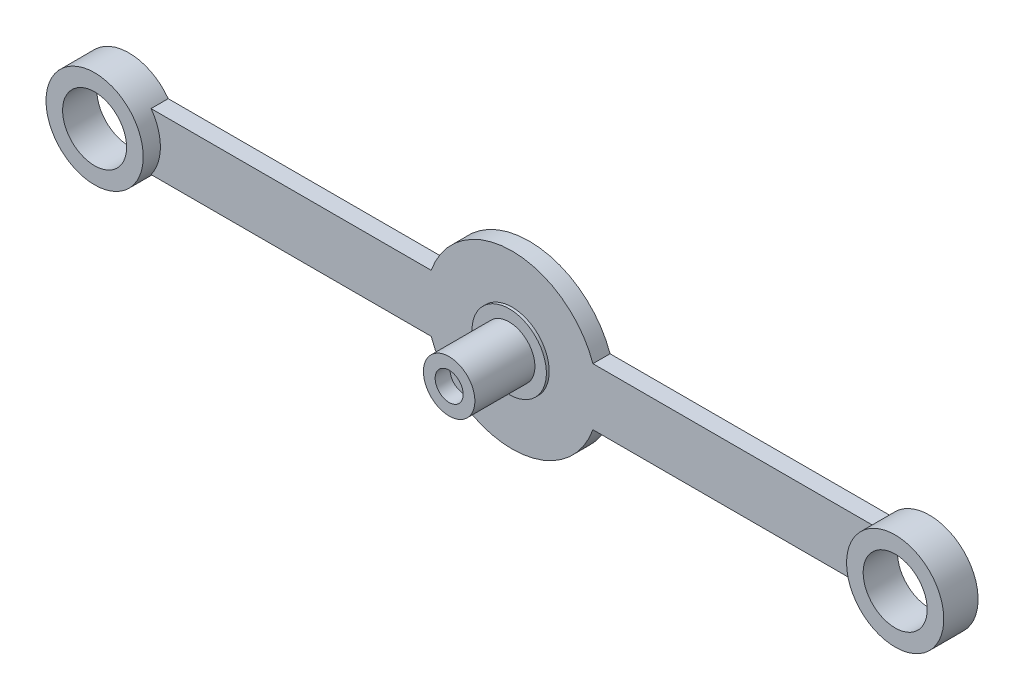
ISO-10303-21;
HEADER;
FILE_DESCRIPTION(('STEP AP214'),'2;1');
FILE_NAME('part.step','',(''),(''),'','','');
FILE_SCHEMA(('AUTOMOTIVE_DESIGN { 1 0 10303 214 1 1 1 1 }'));
ENDSEC;
DATA;
#1=APPLICATION_CONTEXT('core data for automotive mechanical design processes');
#2=APPLICATION_PROTOCOL_DEFINITION('international standard','automotive_design',2000,#1);
#3=PRODUCT_CONTEXT('',#1,'mechanical');
#4=PRODUCT('Part','Part','',(#3));
#5=PRODUCT_RELATED_PRODUCT_CATEGORY('part','',(#4));
#6=PRODUCT_DEFINITION_FORMATION('','',#4);
#7=PRODUCT_DEFINITION_CONTEXT('part definition',#1,'design');
#8=PRODUCT_DEFINITION('design','',#6,#7);
#9=PRODUCT_DEFINITION_SHAPE('','',#8);
#10=(LENGTH_UNIT() NAMED_UNIT(*) SI_UNIT(.MILLI.,.METRE.));
#11=(NAMED_UNIT(*) PLANE_ANGLE_UNIT() SI_UNIT($,.RADIAN.));
#12=(NAMED_UNIT(*) SI_UNIT($,.STERADIAN.) SOLID_ANGLE_UNIT());
#13=UNCERTAINTY_MEASURE_WITH_UNIT(LENGTH_MEASURE(1.E-05),#10,'distance_accuracy_value','');
#14=(GEOMETRIC_REPRESENTATION_CONTEXT(3) GLOBAL_UNCERTAINTY_ASSIGNED_CONTEXT((#13)) GLOBAL_UNIT_ASSIGNED_CONTEXT((#10,
#11,#12)) REPRESENTATION_CONTEXT('',''));
#15=CARTESIAN_POINT('',(0.,0.,0.));
#16=DIRECTION('',(0.,0.,1.));
#17=DIRECTION('',(1.,0.,0.));
#18=AXIS2_PLACEMENT_3D('',#15,#16,#17);
#19=CARTESIAN_POINT('',(0.,0.,-3.));
#20=DIRECTION('',(0.,0.,1.));
#21=DIRECTION('',(1.,0.,0.));
#22=AXIS2_PLACEMENT_3D('',#19,#20,#21);
#23=CYLINDRICAL_SURFACE('',#22,1.2);
#24=CARTESIAN_POINT('',(0.,0.,8.4));
#25=DIRECTION('',(0.,0.,-1.));
#26=DIRECTION('',(-1.,0.,0.));
#27=AXIS2_PLACEMENT_3D('',#24,#25,#26);
#28=CIRCLE('',#27,1.2);
#29=CARTESIAN_POINT('',(-1.2,0.,8.4));
#30=VERTEX_POINT('',#29);
#31=EDGE_CURVE('E200',#30,#30,#28,.T.);
#32=ORIENTED_EDGE('',*,*,#31,.F.);
#33=EDGE_LOOP('',(#32));
#34=FACE_BOUND('',#33,.T.);
#35=CARTESIAN_POINT('',(0.,0.,5.9));
#36=DIRECTION('',(0.,0.,-1.));
#37=DIRECTION('',(-1.,0.,0.));
#38=AXIS2_PLACEMENT_3D('',#35,#36,#37);
#39=CIRCLE('',#38,1.2);
#40=CARTESIAN_POINT('',(-1.2,0.,5.9));
#41=VERTEX_POINT('',#40);
#42=EDGE_CURVE('E50',#41,#41,#39,.F.);
#43=ORIENTED_EDGE('',*,*,#42,.F.);
#44=EDGE_LOOP('',(#43));
#45=FACE_BOUND('',#44,.T.);
#46=ADVANCED_FACE('F46',(#34,#45),#23,.F.);
#47=CARTESIAN_POINT('',(0.,0.,-3.));
#48=DIRECTION('',(0.,0.,1.));
#49=DIRECTION('',(1.,0.,0.));
#50=AXIS2_PLACEMENT_3D('',#47,#48,#49);
#51=CYLINDRICAL_SURFACE('',#50,15.);
#52=CARTESIAN_POINT('',(0.,0.,0.));
#53=DIRECTION('',(0.,0.,1.));
#54=DIRECTION('',(-1.,0.,0.));
#55=AXIS2_PLACEMENT_3D('',#52,#53,#54);
#56=CIRCLE('',#55,15.);
#57=CARTESIAN_POINT('',(14.142135623731,5.,0.));
#58=VERTEX_POINT('',#57);
#59=CARTESIAN_POINT('',(-14.142135623731,5.00000000000001,0.));
#60=VERTEX_POINT('',#59);
#61=EDGE_CURVE('E156',#58,#60,#56,.T.);
#62=ORIENTED_EDGE('',*,*,#61,.F.);
#63=DIRECTION('',(0.,0.,1.));
#64=VECTOR('',#63,1.);
#65=CARTESIAN_POINT('',(14.142135623731,5.,-3.));
#66=LINE('',#65,#64);
#67=CARTESIAN_POINT('',(14.142135623731,5.,-3.));
#68=VERTEX_POINT('',#67);
#69=EDGE_CURVE('E66',#68,#58,#66,.T.);
#70=ORIENTED_EDGE('',*,*,#69,.F.);
#71=CARTESIAN_POINT('',(0.,0.,-3.));
#72=DIRECTION('',(0.,0.,1.));
#73=DIRECTION('',(-1.,0.,0.));
#74=AXIS2_PLACEMENT_3D('',#71,#72,#73);
#75=CIRCLE('',#74,15.);
#76=CARTESIAN_POINT('',(-14.142135623731,5.00000000000001,-3.));
#77=VERTEX_POINT('',#76);
#78=EDGE_CURVE('E179',#68,#77,#75,.T.);
#79=ORIENTED_EDGE('',*,*,#78,.T.);
#80=DIRECTION('',(0.,0.,1.));
#81=VECTOR('',#80,1.);
#82=CARTESIAN_POINT('',(-14.142135623731,5.00000000000001,-3.));
#83=LINE('',#82,#81);
#84=EDGE_CURVE('E103',#77,#60,#83,.T.);
#85=ORIENTED_EDGE('',*,*,#84,.T.);
#86=EDGE_LOOP('',(#62,#70,#79,#85));
#87=FACE_BOUND('',#86,.T.);
#88=ADVANCED_FACE('F287',(#87),#51,.T.);
#89=CARTESIAN_POINT('',(14.142135623731,5.,-3.));
#90=DIRECTION('',(0.,1.,0.));
#91=DIRECTION('',(0.,0.,1.));
#92=AXIS2_PLACEMENT_3D('',#89,#90,#91);
#93=PLANE('',#92);
#94=DIRECTION('',(-1.,0.,0.));
#95=VECTOR('',#94,1.);
#96=CARTESIAN_POINT('',(14.142135623731,5.,0.));
#97=LINE('',#96,#95);
#98=CARTESIAN_POINT('',(63.1261364575662,5.,0.));
#99=VERTEX_POINT('',#98);
#100=EDGE_CURVE('E176',#99,#58,#97,.T.);
#101=ORIENTED_EDGE('',*,*,#100,.F.);
#102=DIRECTION('',(0.,0.,1.));
#103=VECTOR('',#102,1.);
#104=CARTESIAN_POINT('',(63.1261364575662,5.,-3.));
#105=LINE('',#104,#103);
#106=CARTESIAN_POINT('',(63.1261364575662,5.,-3.));
#107=VERTEX_POINT('',#106);
#108=EDGE_CURVE('E133',#107,#99,#105,.T.);
#109=ORIENTED_EDGE('',*,*,#108,.F.);
#110=DIRECTION('',(-1.,0.,0.));
#111=VECTOR('',#110,1.);
#112=CARTESIAN_POINT('',(14.142135623731,5.,-3.));
#113=LINE('',#112,#111);
#114=EDGE_CURVE('E142',#107,#68,#113,.T.);
#115=ORIENTED_EDGE('',*,*,#114,.T.);
#116=ORIENTED_EDGE('',*,*,#69,.T.);
#117=EDGE_LOOP('',(#101,#109,#115,#116));
#118=FACE_BOUND('',#117,.T.);
#119=ADVANCED_FACE('F288',(#118),#93,.T.);
#120=CARTESIAN_POINT('',(70.,0.,-3.));
#121=DIRECTION('',(0.,0.,1.));
#122=DIRECTION('',(1.,0.,0.));
#123=AXIS2_PLACEMENT_3D('',#120,#121,#122);
#124=CYLINDRICAL_SURFACE('',#123,8.5);
#125=ORIENTED_EDGE('',*,*,#108,.T.);
#126=CARTESIAN_POINT('',(70.,0.,0.));
#127=DIRECTION('',(0.,0.,-1.));
#128=DIRECTION('',(-1.,0.,0.));
#129=AXIS2_PLACEMENT_3D('',#126,#127,#128);
#130=CIRCLE('',#129,8.50000000000001);
#131=CARTESIAN_POINT('',(63.1261364575662,-5.,0.));
#132=VERTEX_POINT('',#131);
#133=EDGE_CURVE('E91',#132,#99,#130,.T.);
#134=ORIENTED_EDGE('',*,*,#133,.F.);
#135=DIRECTION('',(0.,0.,1.));
#136=VECTOR('',#135,1.);
#137=CARTESIAN_POINT('',(63.1261364575662,-4.99999999999999,-3.));
#138=LINE('',#137,#136);
#139=CARTESIAN_POINT('',(63.1261364575662,-4.99999999999999,-3.));
#140=VERTEX_POINT('',#139);
#141=EDGE_CURVE('E122',#140,#132,#138,.T.);
#142=ORIENTED_EDGE('',*,*,#141,.F.);
#143=CARTESIAN_POINT('',(70.,0.,-3.));
#144=DIRECTION('',(0.,0.,1.));
#145=DIRECTION('',(1.,0.,0.));
#146=AXIS2_PLACEMENT_3D('',#143,#144,#145);
#147=CIRCLE('',#146,8.5);
#148=EDGE_CURVE('E126',#140,#107,#147,.T.);
#149=ORIENTED_EDGE('',*,*,#148,.T.);
#150=EDGE_LOOP('',(#125,#134,#142,#149));
#151=FACE_BOUND('',#150,.T.);
#152=CARTESIAN_POINT('',(70.,0.,3.));
#153=DIRECTION('',(0.,0.,-1.));
#154=DIRECTION('',(-1.,0.,0.));
#155=AXIS2_PLACEMENT_3D('',#152,#153,#154);
#156=CIRCLE('',#155,8.50000000000001);
#157=CARTESIAN_POINT('',(61.5,0.,3.));
#158=VERTEX_POINT('',#157);
#159=EDGE_CURVE('E228',#158,#158,#156,.T.);
#160=ORIENTED_EDGE('',*,*,#159,.T.);
#161=EDGE_LOOP('',(#160));
#162=FACE_BOUND('',#161,.T.);
#163=ADVANCED_FACE('F124',(#151,#162),#124,.T.);
#164=CARTESIAN_POINT('',(14.142135623731,-5.,-3.));
#165=DIRECTION('',(0.,-1.,0.));
#166=DIRECTION('',(0.,0.,-1.));
#167=AXIS2_PLACEMENT_3D('',#164,#165,#166);
#168=PLANE('',#167);
#169=DIRECTION('',(1.,0.,0.));
#170=VECTOR('',#169,1.);
#171=CARTESIAN_POINT('',(14.142135623731,-5.,0.));
#172=LINE('',#171,#170);
#173=CARTESIAN_POINT('',(14.142135623731,-5.,0.));
#174=VERTEX_POINT('',#173);
#175=EDGE_CURVE('E173',#174,#132,#172,.T.);
#176=ORIENTED_EDGE('',*,*,#175,.F.);
#177=DIRECTION('',(0.,0.,1.));
#178=VECTOR('',#177,1.);
#179=CARTESIAN_POINT('',(14.142135623731,-5.,-3.));
#180=LINE('',#179,#178);
#181=CARTESIAN_POINT('',(14.142135623731,-5.,-3.));
#182=VERTEX_POINT('',#181);
#183=EDGE_CURVE('E134',#182,#174,#180,.T.);
#184=ORIENTED_EDGE('',*,*,#183,.F.);
#185=DIRECTION('',(1.,0.,0.));
#186=VECTOR('',#185,1.);
#187=CARTESIAN_POINT('',(14.142135623731,-5.,-3.));
#188=LINE('',#187,#186);
#189=EDGE_CURVE('E140',#182,#140,#188,.T.);
#190=ORIENTED_EDGE('',*,*,#189,.T.);
#191=ORIENTED_EDGE('',*,*,#141,.T.);
#192=EDGE_LOOP('',(#176,#184,#190,#191));
#193=FACE_BOUND('',#192,.T.);
#194=ADVANCED_FACE('F145',(#193),#168,.T.);
#195=CARTESIAN_POINT('',(0.,0.,-3.));
#196=DIRECTION('',(0.,0.,1.));
#197=DIRECTION('',(1.,0.,0.));
#198=AXIS2_PLACEMENT_3D('',#195,#196,#197);
#199=CYLINDRICAL_SURFACE('',#198,15.);
#200=CARTESIAN_POINT('',(0.,0.,0.));
#201=DIRECTION('',(0.,0.,1.));
#202=DIRECTION('',(1.,0.,0.));
#203=AXIS2_PLACEMENT_3D('',#200,#201,#202);
#204=CIRCLE('',#203,15.);
#205=CARTESIAN_POINT('',(-14.142135623731,-4.99999999999998,0.));
#206=VERTEX_POINT('',#205);
#207=EDGE_CURVE('E169',#206,#174,#204,.T.);
#208=ORIENTED_EDGE('',*,*,#207,.F.);
#209=DIRECTION('',(0.,0.,1.));
#210=VECTOR('',#209,1.);
#211=CARTESIAN_POINT('',(-14.142135623731,-4.99999999999998,-3.));
#212=LINE('',#211,#210);
#213=CARTESIAN_POINT('',(-14.142135623731,-4.99999999999998,-3.));
#214=VERTEX_POINT('',#213);
#215=EDGE_CURVE('E186',#214,#206,#212,.T.);
#216=ORIENTED_EDGE('',*,*,#215,.F.);
#217=CARTESIAN_POINT('',(0.,0.,-3.));
#218=DIRECTION('',(0.,0.,1.));
#219=DIRECTION('',(1.,0.,0.));
#220=AXIS2_PLACEMENT_3D('',#217,#218,#219);
#221=CIRCLE('',#220,15.);
#222=EDGE_CURVE('E147',#214,#182,#221,.T.);
#223=ORIENTED_EDGE('',*,*,#222,.T.);
#224=ORIENTED_EDGE('',*,*,#183,.T.);
#225=EDGE_LOOP('',(#208,#216,#223,#224));
#226=FACE_BOUND('',#225,.T.);
#227=ADVANCED_FACE('F510',(#226),#199,.T.);
#228=CARTESIAN_POINT('',(-14.142135623731,-4.99999999999999,-3.));
#229=DIRECTION('',(0.,-1.,0.));
#230=DIRECTION('',(0.,0.,-1.));
#231=AXIS2_PLACEMENT_3D('',#228,#229,#230);
#232=PLANE('',#231);
#233=DIRECTION('',(1.,0.,0.));
#234=VECTOR('',#233,1.);
#235=CARTESIAN_POINT('',(-14.142135623731,-4.99999999999999,0.));
#236=LINE('',#235,#234);
#237=CARTESIAN_POINT('',(-63.1261364575662,-4.99999999999998,0.));
#238=VERTEX_POINT('',#237);
#239=EDGE_CURVE('E165',#238,#206,#236,.T.);
#240=ORIENTED_EDGE('',*,*,#239,.F.);
#241=DIRECTION('',(0.,0.,1.));
#242=VECTOR('',#241,1.);
#243=CARTESIAN_POINT('',(-63.1261364575662,-4.99999999999999,-3.));
#244=LINE('',#243,#242);
#245=CARTESIAN_POINT('',(-63.1261364575662,-4.99999999999999,-3.));
#246=VERTEX_POINT('',#245);
#247=EDGE_CURVE('E189',#246,#238,#244,.T.);
#248=ORIENTED_EDGE('',*,*,#247,.F.);
#249=DIRECTION('',(1.,0.,0.));
#250=VECTOR('',#249,1.);
#251=CARTESIAN_POINT('',(-14.142135623731,-4.99999999999999,-3.));
#252=LINE('',#251,#250);
#253=EDGE_CURVE('E150',#246,#214,#252,.T.);
#254=ORIENTED_EDGE('',*,*,#253,.T.);
#255=ORIENTED_EDGE('',*,*,#215,.T.);
#256=EDGE_LOOP('',(#240,#248,#254,#255));
#257=FACE_BOUND('',#256,.T.);
#258=ADVANCED_FACE('F278',(#257),#232,.T.);
#259=CARTESIAN_POINT('',(-70.,0.,-3.));
#260=DIRECTION('',(0.,0.,1.));
#261=DIRECTION('',(1.,0.,0.));
#262=AXIS2_PLACEMENT_3D('',#259,#260,#261);
#263=CYLINDRICAL_SURFACE('',#262,8.5);
#264=ORIENTED_EDGE('',*,*,#247,.T.);
#265=CARTESIAN_POINT('',(-70.,0.,0.));
#266=DIRECTION('',(0.,0.,-1.));
#267=DIRECTION('',(-1.,0.,0.));
#268=AXIS2_PLACEMENT_3D('',#265,#266,#267);
#269=CIRCLE('',#268,8.5);
#270=CARTESIAN_POINT('',(-63.1261364575662,5.,0.));
#271=VERTEX_POINT('',#270);
#272=EDGE_CURVE('E242',#271,#238,#269,.T.);
#273=ORIENTED_EDGE('',*,*,#272,.F.);
#274=DIRECTION('',(0.,0.,1.));
#275=VECTOR('',#274,1.);
#276=CARTESIAN_POINT('',(-63.1261364575662,5.,-3.));
#277=LINE('',#276,#275);
#278=CARTESIAN_POINT('',(-63.1261364575662,5.,-3.));
#279=VERTEX_POINT('',#278);
#280=EDGE_CURVE('E193',#279,#271,#277,.T.);
#281=ORIENTED_EDGE('',*,*,#280,.F.);
#282=CARTESIAN_POINT('',(-70.,0.,-3.));
#283=DIRECTION('',(0.,0.,1.));
#284=DIRECTION('',(-1.,0.,0.));
#285=AXIS2_PLACEMENT_3D('',#282,#283,#284);
#286=CIRCLE('',#285,8.5);
#287=EDGE_CURVE('E270',#279,#246,#286,.T.);
#288=ORIENTED_EDGE('',*,*,#287,.T.);
#289=EDGE_LOOP('',(#264,#273,#281,#288));
#290=FACE_BOUND('',#289,.T.);
#291=CARTESIAN_POINT('',(-70.,0.,3.));
#292=DIRECTION('',(0.,0.,-1.));
#293=DIRECTION('',(-1.,0.,0.));
#294=AXIS2_PLACEMENT_3D('',#291,#292,#293);
#295=CIRCLE('',#294,8.5);
#296=CARTESIAN_POINT('',(-78.5,0.,3.));
#297=VERTEX_POINT('',#296);
#298=EDGE_CURVE('E243',#297,#297,#295,.T.);
#299=ORIENTED_EDGE('',*,*,#298,.T.);
#300=EDGE_LOOP('',(#299));
#301=FACE_BOUND('',#300,.T.);
#302=ADVANCED_FACE('F282',(#290,#301),#263,.T.);
#303=CARTESIAN_POINT('',(-14.142135623731,5.00000000000001,-3.));
#304=DIRECTION('',(0.,1.,0.));
#305=DIRECTION('',(0.,0.,1.));
#306=AXIS2_PLACEMENT_3D('',#303,#304,#305);
#307=PLANE('',#306);
#308=DIRECTION('',(-1.,0.,0.));
#309=VECTOR('',#308,1.);
#310=CARTESIAN_POINT('',(-14.142135623731,5.00000000000001,0.));
#311=LINE('',#310,#309);
#312=EDGE_CURVE('E160',#60,#271,#311,.T.);
#313=ORIENTED_EDGE('',*,*,#312,.F.);
#314=ORIENTED_EDGE('',*,*,#84,.F.);
#315=DIRECTION('',(-1.,0.,0.));
#316=VECTOR('',#315,1.);
#317=CARTESIAN_POINT('',(-14.142135623731,5.00000000000001,-3.));
#318=LINE('',#317,#316);
#319=EDGE_CURVE('E267',#77,#279,#318,.T.);
#320=ORIENTED_EDGE('',*,*,#319,.T.);
#321=ORIENTED_EDGE('',*,*,#280,.T.);
#322=EDGE_LOOP('',(#313,#314,#320,#321));
#323=FACE_BOUND('',#322,.T.);
#324=ADVANCED_FACE('F285',(#323),#307,.T.);
#325=CARTESIAN_POINT('',(0.,0.,-3.));
#326=DIRECTION('',(0.,0.,-1.));
#327=DIRECTION('',(-1.,0.,0.));
#328=AXIS2_PLACEMENT_3D('',#325,#326,#327);
#329=PLANE('',#328);
#330=CARTESIAN_POINT('',(0.,0.,-3.));
#331=DIRECTION('',(0.,0.,-1.));
#332=DIRECTION('',(-1.,0.,0.));
#333=AXIS2_PLACEMENT_3D('',#330,#331,#332);
#334=CIRCLE('',#333,2.7);
#335=CARTESIAN_POINT('',(-2.7,0.,-3.));
#336=VERTEX_POINT('',#335);
#337=EDGE_CURVE('E217',#336,#336,#334,.T.);
#338=ORIENTED_EDGE('',*,*,#337,.F.);
#339=EDGE_LOOP('',(#338));
#340=FACE_BOUND('',#339,.T.);
#341=CARTESIAN_POINT('',(-70.,0.,-3.));
#342=DIRECTION('',(0.,0.,1.));
#343=DIRECTION('',(-1.,0.,0.));
#344=AXIS2_PLACEMENT_3D('',#341,#342,#343);
#345=CIRCLE('',#344,5.6);
#346=CARTESIAN_POINT('',(-75.6,0.,-3.));
#347=VERTEX_POINT('',#346);
#348=EDGE_CURVE('E255',#347,#347,#345,.T.);
#349=ORIENTED_EDGE('',*,*,#348,.T.);
#350=EDGE_LOOP('',(#349));
#351=FACE_BOUND('',#350,.T.);
#352=CARTESIAN_POINT('',(70.,0.,-3.));
#353=DIRECTION('',(0.,0.,1.));
#354=DIRECTION('',(1.,0.,0.));
#355=AXIS2_PLACEMENT_3D('',#352,#353,#354);
#356=CIRCLE('',#355,5.6);
#357=CARTESIAN_POINT('',(75.6,0.,-3.));
#358=VERTEX_POINT('',#357);
#359=EDGE_CURVE('E161',#358,#358,#356,.T.);
#360=ORIENTED_EDGE('',*,*,#359,.T.);
#361=EDGE_LOOP('',(#360));
#362=FACE_BOUND('',#361,.T.);
#363=ORIENTED_EDGE('',*,*,#78,.F.);
#364=ORIENTED_EDGE('',*,*,#114,.F.);
#365=ORIENTED_EDGE('',*,*,#148,.F.);
#366=ORIENTED_EDGE('',*,*,#189,.F.);
#367=ORIENTED_EDGE('',*,*,#222,.F.);
#368=ORIENTED_EDGE('',*,*,#253,.F.);
#369=ORIENTED_EDGE('',*,*,#287,.F.);
#370=ORIENTED_EDGE('',*,*,#319,.F.);
#371=EDGE_LOOP('',(#363,#364,#365,#366,#367,#368,#369,#370));
#372=FACE_BOUND('',#371,.T.);
#373=ADVANCED_FACE('F138',(#340,#351,#362,#372),#329,.T.);
#374=CARTESIAN_POINT('',(0.,0.,0.));
#375=DIRECTION('',(0.,0.,-1.));
#376=DIRECTION('',(-1.,0.,0.));
#377=AXIS2_PLACEMENT_3D('',#374,#375,#376);
#378=PLANE('',#377);
#379=CARTESIAN_POINT('',(0.,0.,0.));
#380=DIRECTION('',(0.,0.,-1.));
#381=DIRECTION('',(-1.,0.,0.));
#382=AXIS2_PLACEMENT_3D('',#379,#380,#381);
#383=CIRCLE('',#382,6.5);
#384=CARTESIAN_POINT('',(-6.5,0.,0.));
#385=VERTEX_POINT('',#384);
#386=EDGE_CURVE('E247',#385,#385,#383,.T.);
#387=ORIENTED_EDGE('',*,*,#386,.T.);
#388=EDGE_LOOP('',(#387));
#389=FACE_BOUND('',#388,.T.);
#390=ORIENTED_EDGE('',*,*,#175,.T.);
#391=ORIENTED_EDGE('',*,*,#133,.T.);
#392=ORIENTED_EDGE('',*,*,#100,.T.);
#393=ORIENTED_EDGE('',*,*,#61,.T.);
#394=ORIENTED_EDGE('',*,*,#312,.T.);
#395=ORIENTED_EDGE('',*,*,#272,.T.);
#396=ORIENTED_EDGE('',*,*,#239,.T.);
#397=ORIENTED_EDGE('',*,*,#207,.T.);
#398=EDGE_LOOP('',(#390,#391,#392,#393,#394,#395,#396,#397));
#399=FACE_BOUND('',#398,.T.);
#400=ADVANCED_FACE('F286',(#389,#399),#378,.F.);
#401=CARTESIAN_POINT('',(70.,0.,-3.));
#402=DIRECTION('',(0.,0.,1.));
#403=DIRECTION('',(1.,0.,0.));
#404=AXIS2_PLACEMENT_3D('',#401,#402,#403);
#405=CYLINDRICAL_SURFACE('',#404,5.6);
#406=ORIENTED_EDGE('',*,*,#359,.F.);
#407=EDGE_LOOP('',(#406));
#408=FACE_BOUND('',#407,.T.);
#409=CARTESIAN_POINT('',(70.,0.,3.));
#410=DIRECTION('',(0.,0.,-1.));
#411=DIRECTION('',(-1.,0.,0.));
#412=AXIS2_PLACEMENT_3D('',#409,#410,#411);
#413=CIRCLE('',#412,5.6);
#414=CARTESIAN_POINT('',(64.4,0.,3.));
#415=VERTEX_POINT('',#414);
#416=EDGE_CURVE('E231',#415,#415,#413,.T.);
#417=ORIENTED_EDGE('',*,*,#416,.F.);
#418=EDGE_LOOP('',(#417));
#419=FACE_BOUND('',#418,.T.);
#420=ADVANCED_FACE('F336',(#408,#419),#405,.F.);
#421=CARTESIAN_POINT('',(-70.,0.,-3.));
#422=DIRECTION('',(0.,0.,1.));
#423=DIRECTION('',(1.,0.,0.));
#424=AXIS2_PLACEMENT_3D('',#421,#422,#423);
#425=CYLINDRICAL_SURFACE('',#424,5.6);
#426=ORIENTED_EDGE('',*,*,#348,.F.);
#427=EDGE_LOOP('',(#426));
#428=FACE_BOUND('',#427,.T.);
#429=CARTESIAN_POINT('',(-70.,0.,3.));
#430=DIRECTION('',(0.,0.,-1.));
#431=DIRECTION('',(-1.,0.,0.));
#432=AXIS2_PLACEMENT_3D('',#429,#430,#431);
#433=CIRCLE('',#432,5.6);
#434=CARTESIAN_POINT('',(-75.6,0.,3.));
#435=VERTEX_POINT('',#434);
#436=EDGE_CURVE('E238',#435,#435,#433,.T.);
#437=ORIENTED_EDGE('',*,*,#436,.F.);
#438=EDGE_LOOP('',(#437));
#439=FACE_BOUND('',#438,.T.);
#440=ADVANCED_FACE('F332',(#428,#439),#425,.F.);
#441=CARTESIAN_POINT('',(0.,0.,0.5));
#442=DIRECTION('',(0.,0.,-1.));
#443=DIRECTION('',(-1.,0.,0.));
#444=AXIS2_PLACEMENT_3D('',#441,#442,#443);
#445=CYLINDRICAL_SURFACE('',#444,6.5);
#446=CARTESIAN_POINT('',(0.,0.,0.5));
#447=DIRECTION('',(0.,0.,-1.));
#448=DIRECTION('',(-1.,0.,0.));
#449=AXIS2_PLACEMENT_3D('',#446,#447,#448);
#450=CIRCLE('',#449,6.5);
#451=CARTESIAN_POINT('',(-6.5,0.,0.5));
#452=VERTEX_POINT('',#451);
#453=EDGE_CURVE('E251',#452,#452,#450,.T.);
#454=ORIENTED_EDGE('',*,*,#453,.T.);
#455=EDGE_LOOP('',(#454));
#456=FACE_BOUND('',#455,.T.);
#457=ORIENTED_EDGE('',*,*,#386,.F.);
#458=EDGE_LOOP('',(#457));
#459=FACE_BOUND('',#458,.T.);
#460=ADVANCED_FACE('F328',(#456,#459),#445,.T.);
#461=CARTESIAN_POINT('',(0.,0.,0.5));
#462=DIRECTION('',(0.,0.,-1.));
#463=DIRECTION('',(-1.,0.,0.));
#464=AXIS2_PLACEMENT_3D('',#461,#462,#463);
#465=PLANE('',#464);
#466=CARTESIAN_POINT('',(0.,0.,0.5));
#467=DIRECTION('',(0.,0.,-1.));
#468=DIRECTION('',(-1.,0.,0.));
#469=AXIS2_PLACEMENT_3D('',#466,#467,#468);
#470=CIRCLE('',#469,4.5);
#471=CARTESIAN_POINT('',(-4.5,0.,0.5));
#472=VERTEX_POINT('',#471);
#473=EDGE_CURVE('E13',#472,#472,#470,.T.);
#474=ORIENTED_EDGE('',*,*,#473,.T.);
#475=EDGE_LOOP('',(#474));
#476=FACE_BOUND('',#475,.T.);
#477=ORIENTED_EDGE('',*,*,#453,.F.);
#478=EDGE_LOOP('',(#477));
#479=FACE_BOUND('',#478,.T.);
#480=ADVANCED_FACE('F324',(#476,#479),#465,.F.);
#481=CARTESIAN_POINT('',(0.,0.,11.));
#482=DIRECTION('',(0.,0.,1.));
#483=DIRECTION('',(1.,0.,0.));
#484=AXIS2_PLACEMENT_3D('',#481,#482,#483);
#485=PLANE('',#484);
#486=CARTESIAN_POINT('',(0.,0.,11.));
#487=DIRECTION('',(0.,0.,1.));
#488=DIRECTION('',(1.,0.,0.));
#489=AXIS2_PLACEMENT_3D('',#486,#487,#488);
#490=CIRCLE('',#489,2.45);
#491=CARTESIAN_POINT('',(2.45,0.,11.));
#492=VERTEX_POINT('',#491);
#493=EDGE_CURVE('E203',#492,#492,#490,.T.);
#494=ORIENTED_EDGE('',*,*,#493,.F.);
#495=EDGE_LOOP('',(#494));
#496=FACE_BOUND('',#495,.T.);
#497=CARTESIAN_POINT('',(0.,0.,11.));
#498=DIRECTION('',(0.,0.,1.));
#499=DIRECTION('',(1.,0.,0.));
#500=AXIS2_PLACEMENT_3D('',#497,#498,#499);
#501=CIRCLE('',#500,4.5);
#502=CARTESIAN_POINT('',(4.5,0.,11.));
#503=VERTEX_POINT('',#502);
#504=EDGE_CURVE('E57',#503,#503,#501,.T.);
#505=ORIENTED_EDGE('',*,*,#504,.T.);
#506=EDGE_LOOP('',(#505));
#507=FACE_BOUND('',#506,.T.);
#508=ADVANCED_FACE('F327',(#496,#507),#485,.T.);
#509=CARTESIAN_POINT('',(0.,0.,11.));
#510=DIRECTION('',(0.,0.,-1.));
#511=DIRECTION('',(-1.,0.,0.));
#512=AXIS2_PLACEMENT_3D('',#509,#510,#511);
#513=CYLINDRICAL_SURFACE('',#512,4.5);
#514=ORIENTED_EDGE('',*,*,#504,.F.);
#515=EDGE_LOOP('',(#514));
#516=FACE_BOUND('',#515,.T.);
#517=ORIENTED_EDGE('',*,*,#473,.F.);
#518=EDGE_LOOP('',(#517));
#519=FACE_BOUND('',#518,.T.);
#520=ADVANCED_FACE('F48',(#516,#519),#513,.T.);
#521=CARTESIAN_POINT('',(-70.,0.,3.));
#522=DIRECTION('',(0.,0.,-1.));
#523=DIRECTION('',(-1.,0.,0.));
#524=AXIS2_PLACEMENT_3D('',#521,#522,#523);
#525=PLANE('',#524);
#526=ORIENTED_EDGE('',*,*,#436,.T.);
#527=EDGE_LOOP('',(#526));
#528=FACE_BOUND('',#527,.T.);
#529=ORIENTED_EDGE('',*,*,#298,.F.);
#530=EDGE_LOOP('',(#529));
#531=FACE_BOUND('',#530,.T.);
#532=ADVANCED_FACE('F319',(#528,#531),#525,.F.);
#533=CARTESIAN_POINT('',(70.,0.,3.));
#534=DIRECTION('',(0.,0.,-1.));
#535=DIRECTION('',(-1.,0.,0.));
#536=AXIS2_PLACEMENT_3D('',#533,#534,#535);
#537=PLANE('',#536);
#538=ORIENTED_EDGE('',*,*,#416,.T.);
#539=EDGE_LOOP('',(#538));
#540=FACE_BOUND('',#539,.T.);
#541=ORIENTED_EDGE('',*,*,#159,.F.);
#542=EDGE_LOOP('',(#541));
#543=FACE_BOUND('',#542,.T.);
#544=ADVANCED_FACE('F316',(#540,#543),#537,.F.);
#545=CARTESIAN_POINT('',(0.,0.,8.4));
#546=DIRECTION('',(0.,0.,-1.));
#547=DIRECTION('',(-1.,0.,0.));
#548=AXIS2_PLACEMENT_3D('',#545,#546,#547);
#549=PLANE('',#548);
#550=ORIENTED_EDGE('',*,*,#31,.T.);
#551=EDGE_LOOP('',(#550));
#552=FACE_BOUND('',#551,.T.);
#553=CARTESIAN_POINT('',(0.,0.,8.4));
#554=DIRECTION('',(0.,0.,-1.));
#555=DIRECTION('',(-1.,0.,0.));
#556=AXIS2_PLACEMENT_3D('',#553,#554,#555);
#557=CIRCLE('',#556,2.45);
#558=CARTESIAN_POINT('',(-2.45,0.,8.4));
#559=VERTEX_POINT('',#558);
#560=EDGE_CURVE('E209',#559,#559,#557,.F.);
#561=ORIENTED_EDGE('',*,*,#560,.T.);
#562=EDGE_LOOP('',(#561));
#563=FACE_BOUND('',#562,.T.);
#564=ADVANCED_FACE('F312',(#552,#563),#549,.F.);
#565=CARTESIAN_POINT('',(0.,0.,-6.92964645562817));
#566=DIRECTION('',(0.,0.,1.));
#567=DIRECTION('',(1.,0.,0.));
#568=AXIS2_PLACEMENT_3D('',#565,#566,#567);
#569=CYLINDRICAL_SURFACE('',#568,2.45);
#570=ORIENTED_EDGE('',*,*,#493,.T.);
#571=EDGE_LOOP('',(#570));
#572=FACE_BOUND('',#571,.T.);
#573=ORIENTED_EDGE('',*,*,#560,.F.);
#574=EDGE_LOOP('',(#573));
#575=FACE_BOUND('',#574,.T.);
#576=ADVANCED_FACE('F308',(#572,#575),#569,.F.);
#577=CARTESIAN_POINT('',(0.,0.,5.9));
#578=DIRECTION('',(0.,0.,-1.));
#579=DIRECTION('',(-1.,0.,0.));
#580=AXIS2_PLACEMENT_3D('',#577,#578,#579);
#581=PLANE('',#580);
#582=CARTESIAN_POINT('',(0.,0.,5.9));
#583=DIRECTION('',(0.,0.,-1.));
#584=DIRECTION('',(-1.,0.,0.));
#585=AXIS2_PLACEMENT_3D('',#582,#583,#584);
#586=CIRCLE('',#585,2.7);
#587=CARTESIAN_POINT('',(-2.7,0.,5.9));
#588=VERTEX_POINT('',#587);
#589=EDGE_CURVE('E212',#588,#588,#586,.F.);
#590=ORIENTED_EDGE('',*,*,#589,.F.);
#591=EDGE_LOOP('',(#590));
#592=FACE_BOUND('',#591,.T.);
#593=ORIENTED_EDGE('',*,*,#42,.T.);
#594=EDGE_LOOP('',(#593));
#595=FACE_BOUND('',#594,.T.);
#596=ADVANCED_FACE('F311',(#592,#595),#581,.T.);
#597=CARTESIAN_POINT('',(0.,0.,16.0367532368147));
#598=DIRECTION('',(0.,0.,-1.));
#599=DIRECTION('',(-1.,0.,0.));
#600=AXIS2_PLACEMENT_3D('',#597,#598,#599);
#601=CYLINDRICAL_SURFACE('',#600,2.7);
#602=ORIENTED_EDGE('',*,*,#589,.T.);
#603=EDGE_LOOP('',(#602));
#604=FACE_BOUND('',#603,.T.);
#605=ORIENTED_EDGE('',*,*,#337,.T.);
#606=EDGE_LOOP('',(#605));
#607=FACE_BOUND('',#606,.T.);
#608=ADVANCED_FACE('F306',(#604,#607),#601,.F.);
#609=CLOSED_SHELL('',(#46,#88,#119,#163,#194,#227,#258,#302,#324,#373,#400,#420,#440,#460,#480,
#508,#520,#532,#544,#564,#576,#596,#608));
#610=MANIFOLD_SOLID_BREP('B2',#609);
#611=ADVANCED_BREP_SHAPE_REPRESENTATION('',(#18,#610),#14);
#612=SHAPE_DEFINITION_REPRESENTATION(#9,#611);
ENDSEC;
END-ISO-10303-21;
